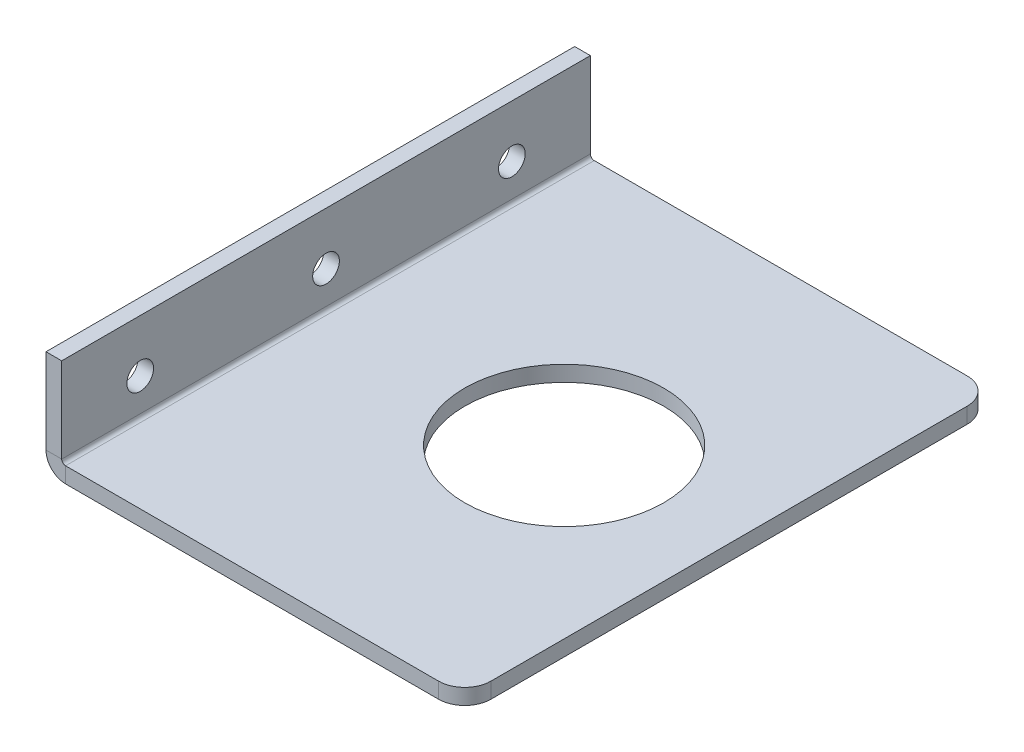
ISO-10303-21;
HEADER;
FILE_DESCRIPTION(('STEP AP214'),'2;1');
FILE_NAME('part.step','',(''),(''),'','','');
FILE_SCHEMA(('AUTOMOTIVE_DESIGN { 1 0 10303 214 1 1 1 1 }'));
ENDSEC;
DATA;
#1=APPLICATION_CONTEXT('core data for automotive mechanical design processes');
#2=APPLICATION_PROTOCOL_DEFINITION('international standard','automotive_design',2000,#1);
#3=PRODUCT_CONTEXT('',#1,'mechanical');
#4=PRODUCT('Part','Part','',(#3));
#5=PRODUCT_RELATED_PRODUCT_CATEGORY('part','',(#4));
#6=PRODUCT_DEFINITION_FORMATION('','',#4);
#7=PRODUCT_DEFINITION_CONTEXT('part definition',#1,'design');
#8=PRODUCT_DEFINITION('design','',#6,#7);
#9=PRODUCT_DEFINITION_SHAPE('','',#8);
#10=(LENGTH_UNIT() NAMED_UNIT(*) SI_UNIT(.MILLI.,.METRE.));
#11=(NAMED_UNIT(*) PLANE_ANGLE_UNIT() SI_UNIT($,.RADIAN.));
#12=(NAMED_UNIT(*) SI_UNIT($,.STERADIAN.) SOLID_ANGLE_UNIT());
#13=UNCERTAINTY_MEASURE_WITH_UNIT(LENGTH_MEASURE(1.E-05),#10,'distance_accuracy_value','');
#14=(GEOMETRIC_REPRESENTATION_CONTEXT(3) GLOBAL_UNCERTAINTY_ASSIGNED_CONTEXT((#13)) GLOBAL_UNIT_ASSIGNED_CONTEXT((#10,
#11,#12)) REPRESENTATION_CONTEXT('',''));
#15=CARTESIAN_POINT('',(0.,0.,0.));
#16=DIRECTION('',(0.,0.,1.));
#17=DIRECTION('',(1.,0.,0.));
#18=AXIS2_PLACEMENT_3D('',#15,#16,#17);
#19=CARTESIAN_POINT('',(0.,3.7366,100.));
#20=DIRECTION('',(0.,0.,1.));
#21=DIRECTION('',(1.,0.,0.));
#22=AXIS2_PLACEMENT_3D('',#19,#20,#21);
#23=PLANE('',#22);
#24=DIRECTION('',(1.,0.,0.));
#25=VECTOR('',#24,1.);
#26=CARTESIAN_POINT('',(0.,3.7366,100.));
#27=LINE('',#26,#25);
#28=CARTESIAN_POINT('',(0.,3.7366,100.));
#29=VERTEX_POINT('',#28);
#30=CARTESIAN_POINT('',(3.,3.7366,100.));
#31=VERTEX_POINT('',#30);
#32=EDGE_CURVE('E200',#29,#31,#27,.T.);
#33=ORIENTED_EDGE('',*,*,#32,.F.);
#34=CARTESIAN_POINT('',(3.7366,3.7366,100.));
#35=DIRECTION('',(0.,0.,-1.));
#36=DIRECTION('',(-1.,0.,0.));
#37=AXIS2_PLACEMENT_3D('',#34,#35,#36);
#38=CIRCLE('',#37,3.7366);
#39=CARTESIAN_POINT('',(3.7366,0.,100.));
#40=VERTEX_POINT('',#39);
#41=EDGE_CURVE('E181',#29,#40,#38,.F.);
#42=ORIENTED_EDGE('',*,*,#41,.T.);
#43=DIRECTION('',(0.,-1.,0.));
#44=VECTOR('',#43,1.);
#45=CARTESIAN_POINT('',(3.7366,3.,100.));
#46=LINE('',#45,#44);
#47=CARTESIAN_POINT('',(3.7366,3.,100.));
#48=VERTEX_POINT('',#47);
#49=EDGE_CURVE('E131',#48,#40,#46,.T.);
#50=ORIENTED_EDGE('',*,*,#49,.F.);
#51=CARTESIAN_POINT('',(3.7366,3.7366,100.));
#52=DIRECTION('',(0.,0.,1.));
#53=DIRECTION('',(1.,0.,0.));
#54=AXIS2_PLACEMENT_3D('',#51,#52,#53);
#55=CIRCLE('',#54,0.7366);
#56=EDGE_CURVE('E143',#31,#48,#55,.T.);
#57=ORIENTED_EDGE('',*,*,#56,.F.);
#58=EDGE_LOOP('',(#33,#42,#50,#57));
#59=FACE_BOUND('',#58,.T.);
#60=ADVANCED_FACE('F39',(#59),#23,.T.);
#61=CARTESIAN_POINT('',(3.7366,3.,100.));
#62=DIRECTION('',(0.,0.,1.));
#63=DIRECTION('',(1.,0.,0.));
#64=AXIS2_PLACEMENT_3D('',#61,#62,#63);
#65=PLANE('',#64);
#66=DIRECTION('',(0.,-1.,0.));
#67=VECTOR('',#66,1.);
#68=CARTESIAN_POINT('',(0.,20.,100.));
#69=LINE('',#68,#67);
#70=CARTESIAN_POINT('',(0.,20.,100.));
#71=VERTEX_POINT('',#70);
#72=EDGE_CURVE('E178',#71,#29,#69,.T.);
#73=ORIENTED_EDGE('',*,*,#72,.T.);
#74=ORIENTED_EDGE('',*,*,#32,.T.);
#75=DIRECTION('',(0.,1.,0.));
#76=VECTOR('',#75,1.);
#77=CARTESIAN_POINT('',(3.,20.,100.));
#78=LINE('',#77,#76);
#79=CARTESIAN_POINT('',(3.,20.,100.));
#80=VERTEX_POINT('',#79);
#81=EDGE_CURVE('E172',#80,#31,#78,.F.);
#82=ORIENTED_EDGE('',*,*,#81,.F.);
#83=DIRECTION('',(1.,0.,0.));
#84=VECTOR('',#83,1.);
#85=CARTESIAN_POINT('',(0.,20.,100.));
#86=LINE('',#85,#84);
#87=EDGE_CURVE('E175',#71,#80,#86,.T.);
#88=ORIENTED_EDGE('',*,*,#87,.F.);
#89=EDGE_LOOP('',(#73,#74,#82,#88));
#90=FACE_BOUND('',#89,.T.);
#91=ADVANCED_FACE('F242',(#90),#65,.T.);
#92=CARTESIAN_POINT('',(3.7366,0.,-1.));
#93=DIRECTION('',(0.,0.,-1.));
#94=DIRECTION('',(-1.,0.,0.));
#95=AXIS2_PLACEMENT_3D('',#92,#93,#94);
#96=PLANE('',#95);
#97=DIRECTION('',(0.,1.,0.));
#98=VECTOR('',#97,1.);
#99=CARTESIAN_POINT('',(3.7366,0.,-1.));
#100=LINE('',#99,#98);
#101=CARTESIAN_POINT('',(3.7366,0.,-1.));
#102=VERTEX_POINT('',#101);
#103=CARTESIAN_POINT('',(3.7366,3.,-1.));
#104=VERTEX_POINT('',#103);
#105=EDGE_CURVE('E119',#102,#104,#100,.T.);
#106=ORIENTED_EDGE('',*,*,#105,.F.);
#107=CARTESIAN_POINT('',(3.7366,3.7366,-1.));
#108=DIRECTION('',(0.,0.,-1.));
#109=DIRECTION('',(-1.,0.,0.));
#110=AXIS2_PLACEMENT_3D('',#107,#108,#109);
#111=CIRCLE('',#110,3.7366);
#112=CARTESIAN_POINT('',(0.,3.7366,-1.));
#113=VERTEX_POINT('',#112);
#114=EDGE_CURVE('E165',#113,#102,#111,.F.);
#115=ORIENTED_EDGE('',*,*,#114,.F.);
#116=DIRECTION('',(-1.,0.,0.));
#117=VECTOR('',#116,1.);
#118=CARTESIAN_POINT('',(3.,3.7366,-1.));
#119=LINE('',#118,#117);
#120=CARTESIAN_POINT('',(3.,3.7366,-1.));
#121=VERTEX_POINT('',#120);
#122=EDGE_CURVE('E132',#121,#113,#119,.T.);
#123=ORIENTED_EDGE('',*,*,#122,.F.);
#124=CARTESIAN_POINT('',(3.7366,3.7366,-1.));
#125=DIRECTION('',(0.,0.,1.));
#126=DIRECTION('',(1.,0.,0.));
#127=AXIS2_PLACEMENT_3D('',#124,#125,#126);
#128=CIRCLE('',#127,0.7366);
#129=EDGE_CURVE('E141',#121,#104,#128,.T.);
#130=ORIENTED_EDGE('',*,*,#129,.T.);
#131=EDGE_LOOP('',(#106,#115,#123,#130));
#132=FACE_BOUND('',#131,.T.);
#133=ADVANCED_FACE('F147',(#132),#96,.T.);
#134=CARTESIAN_POINT('',(3.,3.7366,-1.));
#135=DIRECTION('',(0.,0.,-1.));
#136=DIRECTION('',(-1.,0.,0.));
#137=AXIS2_PLACEMENT_3D('',#134,#135,#136);
#138=PLANE('',#137);
#139=DIRECTION('',(1.,0.,0.));
#140=VECTOR('',#139,1.);
#141=CARTESIAN_POINT('',(0.,3.,-1.));
#142=LINE('',#141,#140);
#143=CARTESIAN_POINT('',(75.,3.,-1.));
#144=VERTEX_POINT('',#143);
#145=EDGE_CURVE('E122',#104,#144,#142,.T.);
#146=ORIENTED_EDGE('',*,*,#145,.T.);
#147=DIRECTION('',(0.,-1.,0.));
#148=VECTOR('',#147,1.);
#149=CARTESIAN_POINT('',(75.,3.7366,-1.));
#150=LINE('',#149,#148);
#151=CARTESIAN_POINT('',(75.,0.,-1.));
#152=VERTEX_POINT('',#151);
#153=EDGE_CURVE('E11',#144,#152,#150,.T.);
#154=ORIENTED_EDGE('',*,*,#153,.T.);
#155=DIRECTION('',(1.,0.,0.));
#156=VECTOR('',#155,1.);
#157=CARTESIAN_POINT('',(0.,0.,-1.));
#158=LINE('',#157,#156);
#159=EDGE_CURVE('E125',#102,#152,#158,.T.);
#160=ORIENTED_EDGE('',*,*,#159,.F.);
#161=ORIENTED_EDGE('',*,*,#105,.T.);
#162=EDGE_LOOP('',(#146,#154,#160,#161));
#163=FACE_BOUND('',#162,.T.);
#164=ADVANCED_FACE('F121',(#163),#138,.T.);
#165=CARTESIAN_POINT('',(0.,0.,100.));
#166=DIRECTION('',(0.,1.,0.));
#167=DIRECTION('',(0.,0.,1.));
#168=AXIS2_PLACEMENT_3D('',#165,#166,#167);
#169=PLANE('',#168);
#170=CARTESIAN_POINT('',(48.,0.,49.));
#171=DIRECTION('',(0.,1.,0.));
#172=DIRECTION('',(0.,0.,1.));
#173=AXIS2_PLACEMENT_3D('',#170,#171,#172);
#174=CIRCLE('',#173,19.);
#175=CARTESIAN_POINT('',(48.,0.,68.));
#176=VERTEX_POINT('',#175);
#177=EDGE_CURVE('E153',#176,#176,#174,.F.);
#178=ORIENTED_EDGE('',*,*,#177,.F.);
#179=EDGE_LOOP('',(#178));
#180=FACE_BOUND('',#179,.T.);
#181=DIRECTION('',(0.,0.,-1.));
#182=VECTOR('',#181,1.);
#183=CARTESIAN_POINT('',(80.,0.,100.));
#184=LINE('',#183,#182);
#185=CARTESIAN_POINT('',(80.,0.,95.));
#186=VERTEX_POINT('',#185);
#187=CARTESIAN_POINT('',(80.,0.,4.));
#188=VERTEX_POINT('',#187);
#189=EDGE_CURVE('E195',#186,#188,#184,.T.);
#190=ORIENTED_EDGE('',*,*,#189,.F.);
#191=CARTESIAN_POINT('',(75.,0.,95.));
#192=DIRECTION('',(0.,1.,0.));
#193=DIRECTION('',(0.,0.,1.));
#194=AXIS2_PLACEMENT_3D('',#191,#192,#193);
#195=CIRCLE('',#194,5.);
#196=CARTESIAN_POINT('',(75.,0.,100.));
#197=VERTEX_POINT('',#196);
#198=EDGE_CURVE('E209',#186,#197,#195,.F.);
#199=ORIENTED_EDGE('',*,*,#198,.T.);
#200=DIRECTION('',(1.,0.,0.));
#201=VECTOR('',#200,1.);
#202=CARTESIAN_POINT('',(0.,0.,100.));
#203=LINE('',#202,#201);
#204=EDGE_CURVE('E167',#40,#197,#203,.T.);
#205=ORIENTED_EDGE('',*,*,#204,.F.);
#206=DIRECTION('',(0.,0.,-1.));
#207=VECTOR('',#206,1.);
#208=CARTESIAN_POINT('',(3.7366,0.,100.));
#209=LINE('',#208,#207);
#210=EDGE_CURVE('E184',#40,#102,#209,.T.);
#211=ORIENTED_EDGE('',*,*,#210,.T.);
#212=ORIENTED_EDGE('',*,*,#159,.T.);
#213=CARTESIAN_POINT('',(75.,0.,4.));
#214=DIRECTION('',(0.,1.,0.));
#215=DIRECTION('',(0.,0.,1.));
#216=AXIS2_PLACEMENT_3D('',#213,#214,#215);
#217=CIRCLE('',#216,5.);
#218=EDGE_CURVE('E207',#152,#188,#217,.F.);
#219=ORIENTED_EDGE('',*,*,#218,.T.);
#220=EDGE_LOOP('',(#190,#199,#205,#211,#212,#219));
#221=FACE_BOUND('',#220,.T.);
#222=ADVANCED_FACE('F223',(#180,#221),#169,.F.);
#223=CARTESIAN_POINT('',(80.,3.,100.));
#224=DIRECTION('',(1.,0.,0.));
#225=DIRECTION('',(0.,0.,-1.));
#226=AXIS2_PLACEMENT_3D('',#223,#224,#225);
#227=PLANE('',#226);
#228=DIRECTION('',(0.,0.,-1.));
#229=VECTOR('',#228,1.);
#230=CARTESIAN_POINT('',(80.,3.,100.));
#231=LINE('',#230,#229);
#232=CARTESIAN_POINT('',(80.,3.,95.));
#233=VERTEX_POINT('',#232);
#234=CARTESIAN_POINT('',(80.,3.,4.));
#235=VERTEX_POINT('',#234);
#236=EDGE_CURVE('E144',#233,#235,#231,.T.);
#237=ORIENTED_EDGE('',*,*,#236,.F.);
#238=DIRECTION('',(0.,-1.,0.));
#239=VECTOR('',#238,1.);
#240=CARTESIAN_POINT('',(80.,3.,95.));
#241=LINE('',#240,#239);
#242=EDGE_CURVE('E204',#233,#186,#241,.T.);
#243=ORIENTED_EDGE('',*,*,#242,.T.);
#244=ORIENTED_EDGE('',*,*,#189,.T.);
#245=DIRECTION('',(0.,-1.,0.));
#246=VECTOR('',#245,1.);
#247=CARTESIAN_POINT('',(80.,3.,4.));
#248=LINE('',#247,#246);
#249=EDGE_CURVE('E202',#188,#235,#248,.F.);
#250=ORIENTED_EDGE('',*,*,#249,.T.);
#251=EDGE_LOOP('',(#237,#243,#244,#250));
#252=FACE_BOUND('',#251,.T.);
#253=ADVANCED_FACE('F217',(#252),#227,.T.);
#254=CARTESIAN_POINT('',(0.,3.,100.));
#255=DIRECTION('',(0.,1.,0.));
#256=DIRECTION('',(0.,0.,1.));
#257=AXIS2_PLACEMENT_3D('',#254,#255,#256);
#258=PLANE('',#257);
#259=CARTESIAN_POINT('',(48.,3.,49.));
#260=DIRECTION('',(0.,1.,0.));
#261=DIRECTION('',(0.,0.,1.));
#262=AXIS2_PLACEMENT_3D('',#259,#260,#261);
#263=CIRCLE('',#262,19.);
#264=CARTESIAN_POINT('',(48.,3.,68.));
#265=VERTEX_POINT('',#264);
#266=EDGE_CURVE('E315',#265,#265,#263,.T.);
#267=ORIENTED_EDGE('',*,*,#266,.F.);
#268=EDGE_LOOP('',(#267));
#269=FACE_BOUND('',#268,.T.);
#270=DIRECTION('',(1.,0.,0.));
#271=VECTOR('',#270,1.);
#272=CARTESIAN_POINT('',(0.,3.,100.));
#273=LINE('',#272,#271);
#274=CARTESIAN_POINT('',(75.,3.,100.));
#275=VERTEX_POINT('',#274);
#276=EDGE_CURVE('E169',#48,#275,#273,.T.);
#277=ORIENTED_EDGE('',*,*,#276,.T.);
#278=CARTESIAN_POINT('',(75.,3.,95.));
#279=DIRECTION('',(0.,1.,0.));
#280=DIRECTION('',(0.,0.,1.));
#281=AXIS2_PLACEMENT_3D('',#278,#279,#280);
#282=CIRCLE('',#281,5.);
#283=EDGE_CURVE('E47',#275,#233,#282,.T.);
#284=ORIENTED_EDGE('',*,*,#283,.T.);
#285=ORIENTED_EDGE('',*,*,#236,.T.);
#286=CARTESIAN_POINT('',(75.,3.,4.));
#287=DIRECTION('',(0.,1.,0.));
#288=DIRECTION('',(0.,0.,1.));
#289=AXIS2_PLACEMENT_3D('',#286,#287,#288);
#290=CIRCLE('',#289,5.);
#291=EDGE_CURVE('E54',#235,#144,#290,.T.);
#292=ORIENTED_EDGE('',*,*,#291,.T.);
#293=ORIENTED_EDGE('',*,*,#145,.F.);
#294=DIRECTION('',(0.,0.,-1.));
#295=VECTOR('',#294,1.);
#296=CARTESIAN_POINT('',(3.7366,3.,100.));
#297=LINE('',#296,#295);
#298=EDGE_CURVE('E138',#48,#104,#297,.T.);
#299=ORIENTED_EDGE('',*,*,#298,.F.);
#300=EDGE_LOOP('',(#277,#284,#285,#292,#293,#299));
#301=FACE_BOUND('',#300,.T.);
#302=ADVANCED_FACE('F151',(#269,#301),#258,.T.);
#303=CARTESIAN_POINT('',(3.7366,3.7366,100.));
#304=DIRECTION('',(0.,0.,-1.));
#305=DIRECTION('',(-1.,0.,0.));
#306=AXIS2_PLACEMENT_3D('',#303,#304,#305);
#307=CYLINDRICAL_SURFACE('',#306,0.7366);
#308=ORIENTED_EDGE('',*,*,#298,.T.);
#309=ORIENTED_EDGE('',*,*,#129,.F.);
#310=DIRECTION('',(0.,0.,-1.));
#311=VECTOR('',#310,1.);
#312=CARTESIAN_POINT('',(3.,3.7366,100.));
#313=LINE('',#312,#311);
#314=EDGE_CURVE('E145',#31,#121,#313,.T.);
#315=ORIENTED_EDGE('',*,*,#314,.F.);
#316=ORIENTED_EDGE('',*,*,#56,.T.);
#317=EDGE_LOOP('',(#308,#309,#315,#316));
#318=FACE_BOUND('',#317,.T.);
#319=ADVANCED_FACE('F139',(#318),#307,.F.);
#320=CARTESIAN_POINT('',(3.,20.,100.));
#321=DIRECTION('',(1.,0.,0.));
#322=DIRECTION('',(0.,0.,-1.));
#323=AXIS2_PLACEMENT_3D('',#320,#321,#322);
#324=PLANE('',#323);
#325=CARTESIAN_POINT('',(3.,10.,85.));
#326=DIRECTION('',(1.,0.,0.));
#327=DIRECTION('',(0.,0.,-1.));
#328=AXIS2_PLACEMENT_3D('',#325,#326,#327);
#329=CIRCLE('',#328,2.55000000000001);
#330=CARTESIAN_POINT('',(3.,10.,82.45));
#331=VERTEX_POINT('',#330);
#332=EDGE_CURVE('E298',#331,#331,#329,.F.);
#333=ORIENTED_EDGE('',*,*,#332,.T.);
#334=EDGE_LOOP('',(#333));
#335=FACE_BOUND('',#334,.T.);
#336=CARTESIAN_POINT('',(3.,10.,49.5));
#337=DIRECTION('',(1.,0.,0.));
#338=DIRECTION('',(0.,0.,-1.));
#339=AXIS2_PLACEMENT_3D('',#336,#337,#338);
#340=CIRCLE('',#339,2.55);
#341=CARTESIAN_POINT('',(3.,10.,46.95));
#342=VERTEX_POINT('',#341);
#343=EDGE_CURVE('E302',#342,#342,#340,.F.);
#344=ORIENTED_EDGE('',*,*,#343,.T.);
#345=EDGE_LOOP('',(#344));
#346=FACE_BOUND('',#345,.T.);
#347=CARTESIAN_POINT('',(3.,10.,14.));
#348=DIRECTION('',(1.,0.,0.));
#349=DIRECTION('',(0.,0.,-1.));
#350=AXIS2_PLACEMENT_3D('',#347,#348,#349);
#351=CIRCLE('',#350,2.55);
#352=CARTESIAN_POINT('',(3.,10.,11.45));
#353=VERTEX_POINT('',#352);
#354=EDGE_CURVE('E310',#353,#353,#351,.F.);
#355=ORIENTED_EDGE('',*,*,#354,.T.);
#356=EDGE_LOOP('',(#355));
#357=FACE_BOUND('',#356,.T.);
#358=ORIENTED_EDGE('',*,*,#314,.T.);
#359=DIRECTION('',(0.,1.,0.));
#360=VECTOR('',#359,1.);
#361=CARTESIAN_POINT('',(3.,20.,-1.));
#362=LINE('',#361,#360);
#363=CARTESIAN_POINT('',(3.,20.,-1.));
#364=VERTEX_POINT('',#363);
#365=EDGE_CURVE('E149',#364,#121,#362,.F.);
#366=ORIENTED_EDGE('',*,*,#365,.F.);
#367=DIRECTION('',(0.,0.,-1.));
#368=VECTOR('',#367,1.);
#369=CARTESIAN_POINT('',(3.,20.,100.));
#370=LINE('',#369,#368);
#371=EDGE_CURVE('E191',#80,#364,#370,.T.);
#372=ORIENTED_EDGE('',*,*,#371,.F.);
#373=ORIENTED_EDGE('',*,*,#81,.T.);
#374=EDGE_LOOP('',(#358,#366,#372,#373));
#375=FACE_BOUND('',#374,.T.);
#376=ADVANCED_FACE('F264',(#335,#346,#357,#375),#324,.T.);
#377=CARTESIAN_POINT('',(0.,20.,100.));
#378=DIRECTION('',(0.,1.,0.));
#379=DIRECTION('',(0.,0.,1.));
#380=AXIS2_PLACEMENT_3D('',#377,#378,#379);
#381=PLANE('',#380);
#382=ORIENTED_EDGE('',*,*,#371,.T.);
#383=DIRECTION('',(1.,0.,0.));
#384=VECTOR('',#383,1.);
#385=CARTESIAN_POINT('',(0.,20.,-1.));
#386=LINE('',#385,#384);
#387=CARTESIAN_POINT('',(0.,20.,-1.));
#388=VERTEX_POINT('',#387);
#389=EDGE_CURVE('E159',#388,#364,#386,.T.);
#390=ORIENTED_EDGE('',*,*,#389,.F.);
#391=DIRECTION('',(0.,0.,-1.));
#392=VECTOR('',#391,1.);
#393=CARTESIAN_POINT('',(0.,20.,100.));
#394=LINE('',#393,#392);
#395=EDGE_CURVE('E189',#71,#388,#394,.T.);
#396=ORIENTED_EDGE('',*,*,#395,.F.);
#397=ORIENTED_EDGE('',*,*,#87,.T.);
#398=EDGE_LOOP('',(#382,#390,#396,#397));
#399=FACE_BOUND('',#398,.T.);
#400=ADVANCED_FACE('F267',(#399),#381,.T.);
#401=CARTESIAN_POINT('',(0.,20.,100.));
#402=DIRECTION('',(1.,0.,0.));
#403=DIRECTION('',(0.,0.,-1.));
#404=AXIS2_PLACEMENT_3D('',#401,#402,#403);
#405=PLANE('',#404);
#406=CARTESIAN_POINT('',(0.,10.,85.));
#407=DIRECTION('',(-1.,0.,0.));
#408=DIRECTION('',(0.,0.,1.));
#409=AXIS2_PLACEMENT_3D('',#406,#407,#408);
#410=CIRCLE('',#409,2.55000000000001);
#411=CARTESIAN_POINT('',(0.,10.,87.55));
#412=VERTEX_POINT('',#411);
#413=EDGE_CURVE('E301',#412,#412,#410,.T.);
#414=ORIENTED_EDGE('',*,*,#413,.F.);
#415=EDGE_LOOP('',(#414));
#416=FACE_BOUND('',#415,.T.);
#417=CARTESIAN_POINT('',(0.,10.,49.5));
#418=DIRECTION('',(-1.,0.,0.));
#419=DIRECTION('',(0.,0.,1.));
#420=AXIS2_PLACEMENT_3D('',#417,#418,#419);
#421=CIRCLE('',#420,2.55);
#422=CARTESIAN_POINT('',(0.,10.,52.05));
#423=VERTEX_POINT('',#422);
#424=EDGE_CURVE('E305',#423,#423,#421,.T.);
#425=ORIENTED_EDGE('',*,*,#424,.F.);
#426=EDGE_LOOP('',(#425));
#427=FACE_BOUND('',#426,.T.);
#428=CARTESIAN_POINT('',(0.,10.,14.));
#429=DIRECTION('',(-1.,0.,0.));
#430=DIRECTION('',(0.,0.,1.));
#431=AXIS2_PLACEMENT_3D('',#428,#429,#430);
#432=CIRCLE('',#431,2.55);
#433=CARTESIAN_POINT('',(0.,10.,16.55));
#434=VERTEX_POINT('',#433);
#435=EDGE_CURVE('E312',#434,#434,#432,.T.);
#436=ORIENTED_EDGE('',*,*,#435,.F.);
#437=EDGE_LOOP('',(#436));
#438=FACE_BOUND('',#437,.T.);
#439=ORIENTED_EDGE('',*,*,#395,.T.);
#440=DIRECTION('',(0.,-1.,0.));
#441=VECTOR('',#440,1.);
#442=CARTESIAN_POINT('',(0.,20.,-1.));
#443=LINE('',#442,#441);
#444=EDGE_CURVE('E162',#388,#113,#443,.T.);
#445=ORIENTED_EDGE('',*,*,#444,.T.);
#446=DIRECTION('',(0.,0.,-1.));
#447=VECTOR('',#446,1.);
#448=CARTESIAN_POINT('',(0.,3.7366,100.));
#449=LINE('',#448,#447);
#450=EDGE_CURVE('E186',#29,#113,#449,.T.);
#451=ORIENTED_EDGE('',*,*,#450,.F.);
#452=ORIENTED_EDGE('',*,*,#72,.F.);
#453=EDGE_LOOP('',(#439,#445,#451,#452));
#454=FACE_BOUND('',#453,.T.);
#455=ADVANCED_FACE('F271',(#416,#427,#438,#454),#405,.F.);
#456=CARTESIAN_POINT('',(3.7366,3.7366,100.));
#457=DIRECTION('',(0.,0.,-1.));
#458=DIRECTION('',(-1.,0.,0.));
#459=AXIS2_PLACEMENT_3D('',#456,#457,#458);
#460=CYLINDRICAL_SURFACE('',#459,3.7366);
#461=ORIENTED_EDGE('',*,*,#450,.T.);
#462=ORIENTED_EDGE('',*,*,#114,.T.);
#463=ORIENTED_EDGE('',*,*,#210,.F.);
#464=ORIENTED_EDGE('',*,*,#41,.F.);
#465=EDGE_LOOP('',(#461,#462,#463,#464));
#466=FACE_BOUND('',#465,.T.);
#467=ADVANCED_FACE('F229',(#466),#460,.T.);
#468=CARTESIAN_POINT('',(3.7366,3.7366,100.));
#469=DIRECTION('',(0.,0.,1.));
#470=DIRECTION('',(1.,0.,0.));
#471=AXIS2_PLACEMENT_3D('',#468,#469,#470);
#472=PLANE('',#471);
#473=ORIENTED_EDGE('',*,*,#204,.T.);
#474=DIRECTION('',(0.,-1.,0.));
#475=VECTOR('',#474,1.);
#476=CARTESIAN_POINT('',(75.,3.7366,100.));
#477=LINE('',#476,#475);
#478=EDGE_CURVE('E62',#197,#275,#477,.F.);
#479=ORIENTED_EDGE('',*,*,#478,.T.);
#480=ORIENTED_EDGE('',*,*,#276,.F.);
#481=ORIENTED_EDGE('',*,*,#49,.T.);
#482=EDGE_LOOP('',(#473,#479,#480,#481));
#483=FACE_BOUND('',#482,.T.);
#484=ADVANCED_FACE('F224',(#483),#472,.T.);
#485=CARTESIAN_POINT('',(3.7366,3.7366,-1.));
#486=DIRECTION('',(0.,0.,1.));
#487=DIRECTION('',(1.,0.,0.));
#488=AXIS2_PLACEMENT_3D('',#485,#486,#487);
#489=PLANE('',#488);
#490=ORIENTED_EDGE('',*,*,#365,.T.);
#491=ORIENTED_EDGE('',*,*,#122,.T.);
#492=ORIENTED_EDGE('',*,*,#444,.F.);
#493=ORIENTED_EDGE('',*,*,#389,.T.);
#494=EDGE_LOOP('',(#490,#491,#492,#493));
#495=FACE_BOUND('',#494,.T.);
#496=ADVANCED_FACE('F240',(#495),#489,.F.);
#497=CARTESIAN_POINT('',(75.,3.,95.));
#498=DIRECTION('',(0.,-1.,0.));
#499=DIRECTION('',(0.,0.,-1.));
#500=AXIS2_PLACEMENT_3D('',#497,#498,#499);
#501=CYLINDRICAL_SURFACE('',#500,5.);
#502=ORIENTED_EDGE('',*,*,#283,.F.);
#503=ORIENTED_EDGE('',*,*,#478,.F.);
#504=ORIENTED_EDGE('',*,*,#198,.F.);
#505=ORIENTED_EDGE('',*,*,#242,.F.);
#506=EDGE_LOOP('',(#502,#503,#504,#505));
#507=FACE_BOUND('',#506,.T.);
#508=ADVANCED_FACE('F220',(#507),#501,.T.);
#509=CARTESIAN_POINT('',(75.,3.7366,4.));
#510=DIRECTION('',(0.,-1.,0.));
#511=DIRECTION('',(0.,0.,-1.));
#512=AXIS2_PLACEMENT_3D('',#509,#510,#511);
#513=CYLINDRICAL_SURFACE('',#512,5.);
#514=ORIENTED_EDGE('',*,*,#291,.F.);
#515=ORIENTED_EDGE('',*,*,#249,.F.);
#516=ORIENTED_EDGE('',*,*,#218,.F.);
#517=ORIENTED_EDGE('',*,*,#153,.F.);
#518=EDGE_LOOP('',(#514,#515,#516,#517));
#519=FACE_BOUND('',#518,.T.);
#520=ADVANCED_FACE('F41',(#519),#513,.T.);
#521=CARTESIAN_POINT('',(48.,-0.00100000000000057,49.));
#522=DIRECTION('',(0.,1.,0.));
#523=DIRECTION('',(0.,0.,1.));
#524=AXIS2_PLACEMENT_3D('',#521,#522,#523);
#525=CYLINDRICAL_SURFACE('',#524,19.);
#526=ORIENTED_EDGE('',*,*,#266,.T.);
#527=EDGE_LOOP('',(#526));
#528=FACE_BOUND('',#527,.T.);
#529=ORIENTED_EDGE('',*,*,#177,.T.);
#530=EDGE_LOOP('',(#529));
#531=FACE_BOUND('',#530,.T.);
#532=ADVANCED_FACE('F232',(#528,#531),#525,.F.);
#533=CARTESIAN_POINT('',(80.001,10.,14.));
#534=DIRECTION('',(-1.,0.,0.));
#535=DIRECTION('',(0.,0.,1.));
#536=AXIS2_PLACEMENT_3D('',#533,#534,#535);
#537=CYLINDRICAL_SURFACE('',#536,2.55);
#538=ORIENTED_EDGE('',*,*,#354,.F.);
#539=EDGE_LOOP('',(#538));
#540=FACE_BOUND('',#539,.T.);
#541=ORIENTED_EDGE('',*,*,#435,.T.);
#542=EDGE_LOOP('',(#541));
#543=FACE_BOUND('',#542,.T.);
#544=ADVANCED_FACE('F237',(#540,#543),#537,.F.);
#545=CARTESIAN_POINT('',(80.001,10.,49.5));
#546=DIRECTION('',(-1.,0.,0.));
#547=DIRECTION('',(0.,0.,1.));
#548=AXIS2_PLACEMENT_3D('',#545,#546,#547);
#549=CYLINDRICAL_SURFACE('',#548,2.55);
#550=ORIENTED_EDGE('',*,*,#343,.F.);
#551=EDGE_LOOP('',(#550));
#552=FACE_BOUND('',#551,.T.);
#553=ORIENTED_EDGE('',*,*,#424,.T.);
#554=EDGE_LOOP('',(#553));
#555=FACE_BOUND('',#554,.T.);
#556=ADVANCED_FACE('F285',(#552,#555),#549,.F.);
#557=CARTESIAN_POINT('',(80.001,10.,85.));
#558=DIRECTION('',(-1.,0.,0.));
#559=DIRECTION('',(0.,0.,1.));
#560=AXIS2_PLACEMENT_3D('',#557,#558,#559);
#561=CYLINDRICAL_SURFACE('',#560,2.55000000000001);
#562=ORIENTED_EDGE('',*,*,#332,.F.);
#563=EDGE_LOOP('',(#562));
#564=FACE_BOUND('',#563,.T.);
#565=ORIENTED_EDGE('',*,*,#413,.T.);
#566=EDGE_LOOP('',(#565));
#567=FACE_BOUND('',#566,.T.);
#568=ADVANCED_FACE('F289',(#564,#567),#561,.F.);
#569=CLOSED_SHELL('',(#60,#91,#133,#164,#222,#253,#302,#319,#376,#400,#455,#467,#484,#496,#508,
#520,#532,#544,#556,#568));
#570=MANIFOLD_SOLID_BREP('B2',#569);
#571=ADVANCED_BREP_SHAPE_REPRESENTATION('',(#18,#570),#14);
#572=SHAPE_DEFINITION_REPRESENTATION(#9,#571);
ENDSEC;
END-ISO-10303-21;
